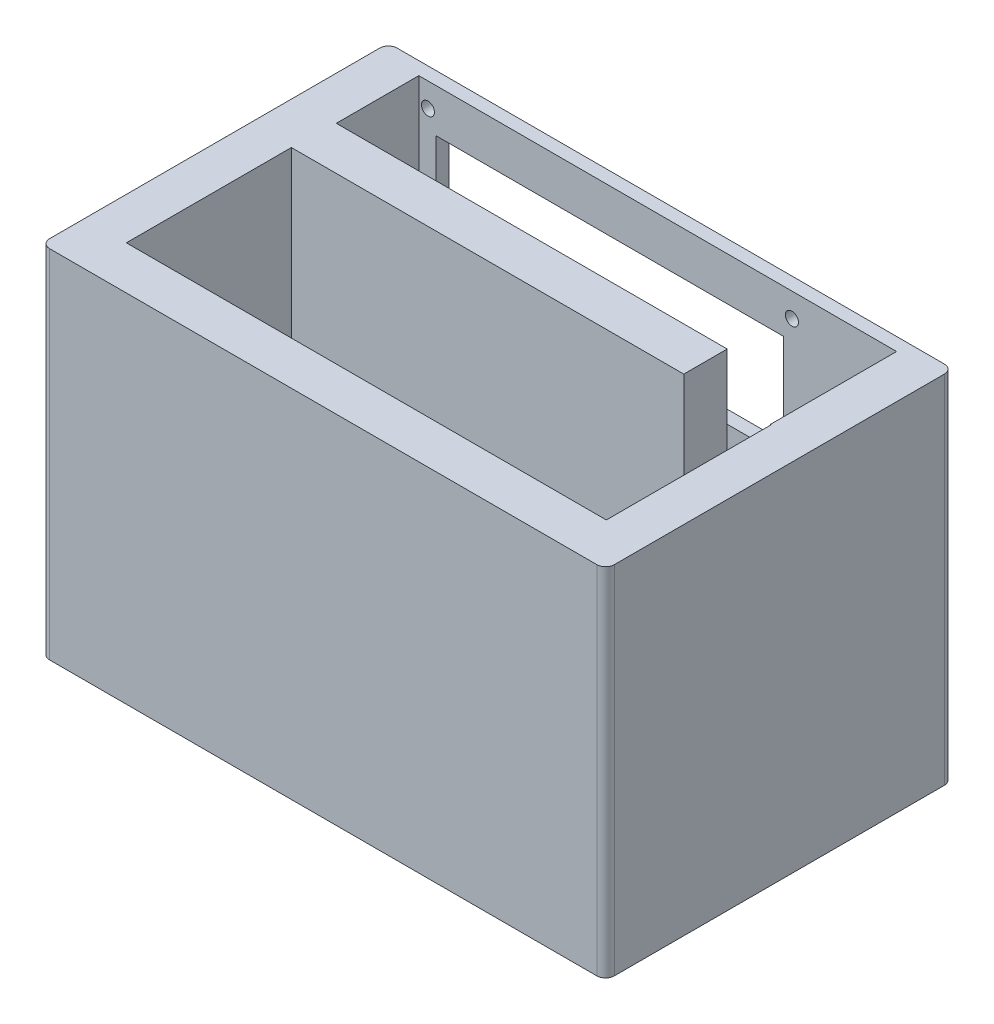
ISO-10303-21;
HEADER;
FILE_DESCRIPTION(('STEP AP214'),'2;1');
FILE_NAME('part.step','',(''),(''),'','','');
FILE_SCHEMA(('AUTOMOTIVE_DESIGN { 1 0 10303 214 1 1 1 1 }'));
ENDSEC;
DATA;
#1=APPLICATION_CONTEXT('core data for automotive mechanical design processes');
#2=APPLICATION_PROTOCOL_DEFINITION('international standard','automotive_design',2000,#1);
#3=PRODUCT_CONTEXT('',#1,'mechanical');
#4=PRODUCT('Part','Part','',(#3));
#5=PRODUCT_RELATED_PRODUCT_CATEGORY('part','',(#4));
#6=PRODUCT_DEFINITION_FORMATION('','',#4);
#7=PRODUCT_DEFINITION_CONTEXT('part definition',#1,'design');
#8=PRODUCT_DEFINITION('design','',#6,#7);
#9=PRODUCT_DEFINITION_SHAPE('','',#8);
#10=(LENGTH_UNIT() NAMED_UNIT(*) SI_UNIT(.MILLI.,.METRE.));
#11=(NAMED_UNIT(*) PLANE_ANGLE_UNIT() SI_UNIT($,.RADIAN.));
#12=(NAMED_UNIT(*) SI_UNIT($,.STERADIAN.) SOLID_ANGLE_UNIT());
#13=UNCERTAINTY_MEASURE_WITH_UNIT(LENGTH_MEASURE(1.E-05),#10,'distance_accuracy_value','');
#14=(GEOMETRIC_REPRESENTATION_CONTEXT(3) GLOBAL_UNCERTAINTY_ASSIGNED_CONTEXT((#13)) GLOBAL_UNIT_ASSIGNED_CONTEXT((#10,
#11,#12)) REPRESENTATION_CONTEXT('',''));
#15=CARTESIAN_POINT('',(0.,0.,0.));
#16=DIRECTION('',(0.,0.,1.));
#17=DIRECTION('',(1.,0.,0.));
#18=AXIS2_PLACEMENT_3D('',#15,#16,#17);
#19=CARTESIAN_POINT('',(-55.3378712972494,4.99999999999999,-8.00000000000001));
#20=DIRECTION('',(0.,0.,-1.));
#21=DIRECTION('',(-1.,0.,0.));
#22=AXIS2_PLACEMENT_3D('',#19,#20,#21);
#23=PLANE('',#22);
#24=DIRECTION('',(-1.,0.,0.));
#25=VECTOR('',#24,1.);
#26=CARTESIAN_POINT('',(-55.3378712972494,4.99999999999999,-8.00000000000001));
#27=LINE('',#26,#25);
#28=CARTESIAN_POINT('',(35.,4.99999999999999,-8.00000000000001));
#29=VERTEX_POINT('',#28);
#30=CARTESIAN_POINT('',(-55.3378712972494,4.99999999999999,-8.00000000000001));
#31=VERTEX_POINT('',#30);
#32=EDGE_CURVE('E282',#29,#31,#27,.T.);
#33=ORIENTED_EDGE('',*,*,#32,.F.);
#34=DIRECTION('',(0.,1.,0.));
#35=VECTOR('',#34,1.);
#36=CARTESIAN_POINT('',(35.,4.99999999999999,-8.00000000000001));
#37=LINE('',#36,#35);
#38=CARTESIAN_POINT('',(35.,82.,-8.00000000000001));
#39=VERTEX_POINT('',#38);
#40=EDGE_CURVE('E274',#29,#39,#37,.T.);
#41=ORIENTED_EDGE('',*,*,#40,.T.);
#42=DIRECTION('',(-1.,0.,0.));
#43=VECTOR('',#42,1.);
#44=CARTESIAN_POINT('',(-55.3378712972494,82.,-8.00000000000001));
#45=LINE('',#44,#43);
#46=CARTESIAN_POINT('',(-55.3378712972494,82.,-8.00000000000001));
#47=VERTEX_POINT('',#46);
#48=EDGE_CURVE('E296',#39,#47,#45,.T.);
#49=ORIENTED_EDGE('',*,*,#48,.T.);
#50=DIRECTION('',(0.,1.,0.));
#51=VECTOR('',#50,1.);
#52=CARTESIAN_POINT('',(-55.3378712972494,4.99999999999999,-8.00000000000001));
#53=LINE('',#52,#51);
#54=EDGE_CURVE('E299',#31,#47,#53,.T.);
#55=ORIENTED_EDGE('',*,*,#54,.F.);
#56=EDGE_LOOP('',(#33,#41,#49,#55));
#57=FACE_BOUND('',#56,.T.);
#58=ADVANCED_FACE('F81',(#57),#23,.F.);
#59=CARTESIAN_POINT('',(-65.,82.,-40.));
#60=DIRECTION('',(1.,0.,0.));
#61=DIRECTION('',(0.,0.,-1.));
#62=AXIS2_PLACEMENT_3D('',#59,#60,#61);
#63=PLANE('',#62);
#64=DIRECTION('',(0.,0.,1.));
#65=VECTOR('',#64,1.);
#66=CARTESIAN_POINT('',(-65.,0.,-40.));
#67=LINE('',#66,#65);
#68=CARTESIAN_POINT('',(-65.,0.,-38.));
#69=VERTEX_POINT('',#68);
#70=CARTESIAN_POINT('',(-65.,0.,38.));
#71=VERTEX_POINT('',#70);
#72=EDGE_CURVE('E362',#69,#71,#67,.T.);
#73=ORIENTED_EDGE('',*,*,#72,.T.);
#74=DIRECTION('',(0.,-1.,0.));
#75=VECTOR('',#74,1.);
#76=CARTESIAN_POINT('',(-65.,82.,38.));
#77=LINE('',#76,#75);
#78=CARTESIAN_POINT('',(-65.,82.,38.));
#79=VERTEX_POINT('',#78);
#80=EDGE_CURVE('E442',#71,#79,#77,.F.);
#81=ORIENTED_EDGE('',*,*,#80,.T.);
#82=DIRECTION('',(0.,0.,1.));
#83=VECTOR('',#82,1.);
#84=CARTESIAN_POINT('',(-65.,82.,-40.));
#85=LINE('',#84,#83);
#86=CARTESIAN_POINT('',(-65.,82.,-38.));
#87=VERTEX_POINT('',#86);
#88=EDGE_CURVE('E366',#87,#79,#85,.T.);
#89=ORIENTED_EDGE('',*,*,#88,.F.);
#90=DIRECTION('',(0.,-1.,0.));
#91=VECTOR('',#90,1.);
#92=CARTESIAN_POINT('',(-65.,82.,-38.));
#93=LINE('',#92,#91);
#94=EDGE_CURVE('E439',#87,#69,#93,.T.);
#95=ORIENTED_EDGE('',*,*,#94,.T.);
#96=EDGE_LOOP('',(#73,#81,#89,#95));
#97=FACE_BOUND('',#96,.T.);
#98=ADVANCED_FACE('F462',(#97),#63,.F.);
#99=CARTESIAN_POINT('',(-65.,82.,40.));
#100=DIRECTION('',(0.,0.,-1.));
#101=DIRECTION('',(-1.,0.,0.));
#102=AXIS2_PLACEMENT_3D('',#99,#100,#101);
#103=PLANE('',#102);
#104=DIRECTION('',(1.,0.,0.));
#105=VECTOR('',#104,1.);
#106=CARTESIAN_POINT('',(-65.,0.,40.));
#107=LINE('',#106,#105);
#108=CARTESIAN_POINT('',(-63.,0.,40.));
#109=VERTEX_POINT('',#108);
#110=CARTESIAN_POINT('',(63.,0.,40.));
#111=VERTEX_POINT('',#110);
#112=EDGE_CURVE('E382',#109,#111,#107,.T.);
#113=ORIENTED_EDGE('',*,*,#112,.T.);
#114=DIRECTION('',(0.,-1.,0.));
#115=VECTOR('',#114,1.);
#116=CARTESIAN_POINT('',(63.,82.,40.));
#117=LINE('',#116,#115);
#118=CARTESIAN_POINT('',(63.,82.,40.));
#119=VERTEX_POINT('',#118);
#120=EDGE_CURVE('E429',#111,#119,#117,.F.);
#121=ORIENTED_EDGE('',*,*,#120,.T.);
#122=DIRECTION('',(1.,0.,0.));
#123=VECTOR('',#122,1.);
#124=CARTESIAN_POINT('',(-65.,82.,40.));
#125=LINE('',#124,#123);
#126=CARTESIAN_POINT('',(-63.,82.,40.));
#127=VERTEX_POINT('',#126);
#128=EDGE_CURVE('E369',#127,#119,#125,.T.);
#129=ORIENTED_EDGE('',*,*,#128,.F.);
#130=DIRECTION('',(0.,-1.,0.));
#131=VECTOR('',#130,1.);
#132=CARTESIAN_POINT('',(-63.,82.,40.));
#133=LINE('',#132,#131);
#134=EDGE_CURVE('E426',#127,#109,#133,.T.);
#135=ORIENTED_EDGE('',*,*,#134,.T.);
#136=EDGE_LOOP('',(#113,#121,#129,#135));
#137=FACE_BOUND('',#136,.T.);
#138=ADVANCED_FACE('F473',(#137),#103,.F.);
#139=CARTESIAN_POINT('',(65.,82.,-40.));
#140=DIRECTION('',(-1.,0.,0.));
#141=DIRECTION('',(0.,0.,1.));
#142=AXIS2_PLACEMENT_3D('',#139,#140,#141);
#143=PLANE('',#142);
#144=DIRECTION('',(0.,0.,-1.));
#145=VECTOR('',#144,1.);
#146=CARTESIAN_POINT('',(65.,82.,-40.));
#147=LINE('',#146,#145);
#148=CARTESIAN_POINT('',(65.,82.,38.));
#149=VERTEX_POINT('',#148);
#150=CARTESIAN_POINT('',(65.,82.,-38.));
#151=VERTEX_POINT('',#150);
#152=EDGE_CURVE('E373',#149,#151,#147,.T.);
#153=ORIENTED_EDGE('',*,*,#152,.F.);
#154=DIRECTION('',(0.,-1.,0.));
#155=VECTOR('',#154,1.);
#156=CARTESIAN_POINT('',(65.,82.,38.));
#157=LINE('',#156,#155);
#158=CARTESIAN_POINT('',(65.,0.,38.));
#159=VERTEX_POINT('',#158);
#160=EDGE_CURVE('E415',#149,#159,#157,.T.);
#161=ORIENTED_EDGE('',*,*,#160,.T.);
#162=DIRECTION('',(0.,0.,-1.));
#163=VECTOR('',#162,1.);
#164=CARTESIAN_POINT('',(65.,0.,-40.));
#165=LINE('',#164,#163);
#166=CARTESIAN_POINT('',(65.,0.,-38.));
#167=VERTEX_POINT('',#166);
#168=EDGE_CURVE('E385',#159,#167,#165,.T.);
#169=ORIENTED_EDGE('',*,*,#168,.T.);
#170=DIRECTION('',(0.,-1.,0.));
#171=VECTOR('',#170,1.);
#172=CARTESIAN_POINT('',(65.,82.,-38.));
#173=LINE('',#172,#171);
#174=EDGE_CURVE('E413',#167,#151,#173,.F.);
#175=ORIENTED_EDGE('',*,*,#174,.T.);
#176=EDGE_LOOP('',(#153,#161,#169,#175));
#177=FACE_BOUND('',#176,.T.);
#178=ADVANCED_FACE('F481',(#177),#143,.F.);
#179=CARTESIAN_POINT('',(-65.,82.,-40.));
#180=DIRECTION('',(0.,0.,1.));
#181=DIRECTION('',(1.,0.,0.));
#182=AXIS2_PLACEMENT_3D('',#179,#180,#181);
#183=PLANE('',#182);
#184=CARTESIAN_POINT('',(-52.9,8.49999999999999,-40.));
#185=DIRECTION('',(0.,0.,1.));
#186=DIRECTION('',(1.,0.,0.));
#187=AXIS2_PLACEMENT_3D('',#184,#185,#186);
#188=CIRCLE('',#187,1.5);
#189=CARTESIAN_POINT('',(-51.4,8.49999999999999,-40.));
#190=VERTEX_POINT('',#189);
#191=EDGE_CURVE('E750',#190,#190,#188,.T.);
#192=ORIENTED_EDGE('',*,*,#191,.T.);
#193=EDGE_LOOP('',(#192));
#194=FACE_BOUND('',#193,.T.);
#195=CARTESIAN_POINT('',(30.9,8.49999999999999,-40.));
#196=DIRECTION('',(0.,0.,-1.));
#197=DIRECTION('',(-1.,0.,0.));
#198=AXIS2_PLACEMENT_3D('',#195,#196,#197);
#199=CIRCLE('',#198,1.5);
#200=CARTESIAN_POINT('',(29.4,8.49999999999999,-40.));
#201=VERTEX_POINT('',#200);
#202=EDGE_CURVE('E760',#201,#201,#199,.T.);
#203=ORIENTED_EDGE('',*,*,#202,.F.);
#204=EDGE_LOOP('',(#203));
#205=FACE_BOUND('',#204,.T.);
#206=CARTESIAN_POINT('',(-52.9,76.5,-40.));
#207=DIRECTION('',(0.,0.,1.));
#208=DIRECTION('',(1.,0.,0.));
#209=AXIS2_PLACEMENT_3D('',#206,#207,#208);
#210=CIRCLE('',#209,1.5);
#211=CARTESIAN_POINT('',(-51.4,76.5,-40.));
#212=VERTEX_POINT('',#211);
#213=EDGE_CURVE('E764',#212,#212,#210,.T.);
#214=ORIENTED_EDGE('',*,*,#213,.T.);
#215=EDGE_LOOP('',(#214));
#216=FACE_BOUND('',#215,.T.);
#217=CARTESIAN_POINT('',(30.9,76.5,-40.));
#218=DIRECTION('',(0.,0.,-1.));
#219=DIRECTION('',(-1.,0.,0.));
#220=AXIS2_PLACEMENT_3D('',#217,#218,#219);
#221=CIRCLE('',#220,1.5);
#222=CARTESIAN_POINT('',(29.4,76.5,-40.));
#223=VERTEX_POINT('',#222);
#224=EDGE_CURVE('E772',#223,#223,#221,.T.);
#225=ORIENTED_EDGE('',*,*,#224,.F.);
#226=EDGE_LOOP('',(#225));
#227=FACE_BOUND('',#226,.T.);
#228=CARTESIAN_POINT('',(-52.9,45.5,-40.));
#229=DIRECTION('',(0.,0.,1.));
#230=DIRECTION('',(1.,0.,0.));
#231=AXIS2_PLACEMENT_3D('',#228,#229,#230);
#232=CIRCLE('',#231,1.5);
#233=CARTESIAN_POINT('',(-51.4,45.5,-40.));
#234=VERTEX_POINT('',#233);
#235=EDGE_CURVE('E776',#234,#234,#232,.T.);
#236=ORIENTED_EDGE('',*,*,#235,.T.);
#237=EDGE_LOOP('',(#236));
#238=FACE_BOUND('',#237,.T.);
#239=CARTESIAN_POINT('',(-52.9,39.5,-40.));
#240=DIRECTION('',(0.,0.,1.));
#241=DIRECTION('',(1.,0.,0.));
#242=AXIS2_PLACEMENT_3D('',#239,#240,#241);
#243=CIRCLE('',#242,1.5);
#244=CARTESIAN_POINT('',(-51.4,39.5,-40.));
#245=VERTEX_POINT('',#244);
#246=EDGE_CURVE('E782',#245,#245,#243,.T.);
#247=ORIENTED_EDGE('',*,*,#246,.T.);
#248=EDGE_LOOP('',(#247));
#249=FACE_BOUND('',#248,.T.);
#250=CARTESIAN_POINT('',(30.9,45.5,-40.));
#251=DIRECTION('',(0.,0.,-1.));
#252=DIRECTION('',(-1.,0.,0.));
#253=AXIS2_PLACEMENT_3D('',#250,#251,#252);
#254=CIRCLE('',#253,1.5);
#255=CARTESIAN_POINT('',(29.4,45.5,-40.));
#256=VERTEX_POINT('',#255);
#257=EDGE_CURVE('E790',#256,#256,#254,.T.);
#258=ORIENTED_EDGE('',*,*,#257,.F.);
#259=EDGE_LOOP('',(#258));
#260=FACE_BOUND('',#259,.T.);
#261=CARTESIAN_POINT('',(30.9,39.5,-40.));
#262=DIRECTION('',(0.,0.,-1.));
#263=DIRECTION('',(-1.,0.,0.));
#264=AXIS2_PLACEMENT_3D('',#261,#262,#263);
#265=CIRCLE('',#264,1.5);
#266=CARTESIAN_POINT('',(29.4,39.5,-40.));
#267=VERTEX_POINT('',#266);
#268=EDGE_CURVE('E796',#267,#267,#265,.T.);
#269=ORIENTED_EDGE('',*,*,#268,.F.);
#270=EDGE_LOOP('',(#269));
#271=FACE_BOUND('',#270,.T.);
#272=DIRECTION('',(-1.,0.,0.));
#273=VECTOR('',#272,1.);
#274=CARTESIAN_POINT('',(29.,48.,-40.));
#275=LINE('',#274,#273);
#276=CARTESIAN_POINT('',(29.,48.,-40.));
#277=VERTEX_POINT('',#276);
#278=CARTESIAN_POINT('',(-51.,48.,-40.));
#279=VERTEX_POINT('',#278);
#280=EDGE_CURVE('E306',#277,#279,#275,.T.);
#281=ORIENTED_EDGE('',*,*,#280,.F.);
#282=DIRECTION('',(0.,-1.,0.));
#283=VECTOR('',#282,1.);
#284=CARTESIAN_POINT('',(29.,72.,-40.));
#285=LINE('',#284,#283);
#286=CARTESIAN_POINT('',(29.,72.,-40.));
#287=VERTEX_POINT('',#286);
#288=EDGE_CURVE('E301',#287,#277,#285,.T.);
#289=ORIENTED_EDGE('',*,*,#288,.F.);
#290=DIRECTION('',(1.,0.,0.));
#291=VECTOR('',#290,1.);
#292=CARTESIAN_POINT('',(29.,72.,-40.));
#293=LINE('',#292,#291);
#294=CARTESIAN_POINT('',(-51.,72.,-40.));
#295=VERTEX_POINT('',#294);
#296=EDGE_CURVE('E312',#295,#287,#293,.T.);
#297=ORIENTED_EDGE('',*,*,#296,.F.);
#298=DIRECTION('',(0.,1.,0.));
#299=VECTOR('',#298,1.);
#300=CARTESIAN_POINT('',(-51.,72.,-40.));
#301=LINE('',#300,#299);
#302=EDGE_CURVE('E309',#279,#295,#301,.T.);
#303=ORIENTED_EDGE('',*,*,#302,.F.);
#304=EDGE_LOOP('',(#281,#289,#297,#303));
#305=FACE_BOUND('',#304,.T.);
#306=DIRECTION('',(-1.,0.,0.));
#307=VECTOR('',#306,1.);
#308=CARTESIAN_POINT('',(29.,11.,-40.));
#309=LINE('',#308,#307);
#310=CARTESIAN_POINT('',(29.,11.,-40.));
#311=VERTEX_POINT('',#310);
#312=CARTESIAN_POINT('',(-51.,11.,-40.));
#313=VERTEX_POINT('',#312);
#314=EDGE_CURVE('E326',#311,#313,#309,.T.);
#315=ORIENTED_EDGE('',*,*,#314,.F.);
#316=DIRECTION('',(0.,-1.,0.));
#317=VECTOR('',#316,1.);
#318=CARTESIAN_POINT('',(29.,35.,-40.));
#319=LINE('',#318,#317);
#320=CARTESIAN_POINT('',(29.,35.,-40.));
#321=VERTEX_POINT('',#320);
#322=EDGE_CURVE('E318',#321,#311,#319,.T.);
#323=ORIENTED_EDGE('',*,*,#322,.F.);
#324=DIRECTION('',(1.,0.,0.));
#325=VECTOR('',#324,1.);
#326=CARTESIAN_POINT('',(29.,35.,-40.));
#327=LINE('',#326,#325);
#328=CARTESIAN_POINT('',(-51.,35.,-40.));
#329=VERTEX_POINT('',#328);
#330=EDGE_CURVE('E332',#329,#321,#327,.T.);
#331=ORIENTED_EDGE('',*,*,#330,.F.);
#332=DIRECTION('',(0.,1.,0.));
#333=VECTOR('',#332,1.);
#334=CARTESIAN_POINT('',(-51.,35.,-40.));
#335=LINE('',#334,#333);
#336=EDGE_CURVE('E329',#313,#329,#335,.T.);
#337=ORIENTED_EDGE('',*,*,#336,.F.);
#338=EDGE_LOOP('',(#315,#323,#331,#337));
#339=FACE_BOUND('',#338,.T.);
#340=DIRECTION('',(-1.,0.,0.));
#341=VECTOR('',#340,1.);
#342=CARTESIAN_POINT('',(-65.,0.,-40.));
#343=LINE('',#342,#341);
#344=CARTESIAN_POINT('',(63.,0.,-40.));
#345=VERTEX_POINT('',#344);
#346=CARTESIAN_POINT('',(-63.,0.,-40.));
#347=VERTEX_POINT('',#346);
#348=EDGE_CURVE('E370',#345,#347,#343,.T.);
#349=ORIENTED_EDGE('',*,*,#348,.T.);
#350=DIRECTION('',(0.,-1.,0.));
#351=VECTOR('',#350,1.);
#352=CARTESIAN_POINT('',(-63.,82.,-40.));
#353=LINE('',#352,#351);
#354=CARTESIAN_POINT('',(-63.,82.,-40.));
#355=VERTEX_POINT('',#354);
#356=EDGE_CURVE('E12',#347,#355,#353,.F.);
#357=ORIENTED_EDGE('',*,*,#356,.T.);
#358=DIRECTION('',(-1.,0.,0.));
#359=VECTOR('',#358,1.);
#360=CARTESIAN_POINT('',(-65.,82.,-40.));
#361=LINE('',#360,#359);
#362=CARTESIAN_POINT('',(63.,82.,-40.));
#363=VERTEX_POINT('',#362);
#364=EDGE_CURVE('E376',#363,#355,#361,.T.);
#365=ORIENTED_EDGE('',*,*,#364,.F.);
#366=DIRECTION('',(0.,-1.,0.));
#367=VECTOR('',#366,1.);
#368=CARTESIAN_POINT('',(63.,82.,-40.));
#369=LINE('',#368,#367);
#370=EDGE_CURVE('E89',#363,#345,#369,.T.);
#371=ORIENTED_EDGE('',*,*,#370,.T.);
#372=EDGE_LOOP('',(#349,#357,#365,#371));
#373=FACE_BOUND('',#372,.T.);
#374=ADVANCED_FACE('F448',(#194,#205,#216,#227,#238,#249,#260,#271,#305,#339,#373),#183,.F.);
#375=CARTESIAN_POINT('',(0.,82.,0.));
#376=DIRECTION('',(0.,1.,0.));
#377=DIRECTION('',(0.,0.,1.));
#378=AXIS2_PLACEMENT_3D('',#375,#376,#377);
#379=PLANE('',#378);
#380=DIRECTION('',(0.,0.,1.));
#381=VECTOR('',#380,1.);
#382=CARTESIAN_POINT('',(35.,82.,-8.00000000000001));
#383=LINE('',#382,#381);
#384=CARTESIAN_POINT('',(35.,82.,-18.));
#385=VERTEX_POINT('',#384);
#386=EDGE_CURVE('E799',#385,#39,#383,.T.);
#387=ORIENTED_EDGE('',*,*,#386,.F.);
#388=DIRECTION('',(1.,0.,0.));
#389=VECTOR('',#388,1.);
#390=CARTESIAN_POINT('',(55.,82.,-18.));
#391=LINE('',#390,#389);
#392=CARTESIAN_POINT('',(-55.,82.,-18.));
#393=VERTEX_POINT('',#392);
#394=EDGE_CURVE('E265',#393,#385,#391,.T.);
#395=ORIENTED_EDGE('',*,*,#394,.F.);
#396=DIRECTION('',(0.,0.,1.));
#397=VECTOR('',#396,1.);
#398=CARTESIAN_POINT('',(-55.,82.,-18.));
#399=LINE('',#398,#397);
#400=CARTESIAN_POINT('',(-55.,82.,-37.));
#401=VERTEX_POINT('',#400);
#402=EDGE_CURVE('E355',#401,#393,#399,.T.);
#403=ORIENTED_EDGE('',*,*,#402,.F.);
#404=DIRECTION('',(-1.,0.,0.));
#405=VECTOR('',#404,1.);
#406=CARTESIAN_POINT('',(55.,82.,-37.));
#407=LINE('',#406,#405);
#408=CARTESIAN_POINT('',(55.,82.,-37.));
#409=VERTEX_POINT('',#408);
#410=EDGE_CURVE('E352',#409,#401,#407,.T.);
#411=ORIENTED_EDGE('',*,*,#410,.F.);
#412=DIRECTION('',(0.,0.,-1.));
#413=VECTOR('',#412,1.);
#414=CARTESIAN_POINT('',(55.,82.,-18.));
#415=LINE('',#414,#413);
#416=CARTESIAN_POINT('',(55.,82.,-8.00000000000001));
#417=VERTEX_POINT('',#416);
#418=EDGE_CURVE('E338',#417,#409,#415,.T.);
#419=ORIENTED_EDGE('',*,*,#418,.F.);
#420=CARTESIAN_POINT('',(55.1719406486813,82.,-8.00000000000001));
#421=VERTEX_POINT('',#420);
#422=EDGE_CURVE('E272',#421,#417,#45,.T.);
#423=ORIENTED_EDGE('',*,*,#422,.F.);
#424=DIRECTION('',(0.,0.,-1.));
#425=VECTOR('',#424,1.);
#426=CARTESIAN_POINT('',(55.1719406486813,82.,30.));
#427=LINE('',#426,#425);
#428=CARTESIAN_POINT('',(55.1719406486813,82.,30.));
#429=VERTEX_POINT('',#428);
#430=EDGE_CURVE('E293',#429,#421,#427,.T.);
#431=ORIENTED_EDGE('',*,*,#430,.F.);
#432=DIRECTION('',(1.,0.,0.));
#433=VECTOR('',#432,1.);
#434=CARTESIAN_POINT('',(-55.3378712972494,82.,30.));
#435=LINE('',#434,#433);
#436=CARTESIAN_POINT('',(-55.3378712972494,82.,30.));
#437=VERTEX_POINT('',#436);
#438=EDGE_CURVE('E290',#437,#429,#435,.T.);
#439=ORIENTED_EDGE('',*,*,#438,.F.);
#440=DIRECTION('',(0.,0.,1.));
#441=VECTOR('',#440,1.);
#442=CARTESIAN_POINT('',(-55.3378712972494,82.,30.));
#443=LINE('',#442,#441);
#444=EDGE_CURVE('E104',#47,#437,#443,.T.);
#445=ORIENTED_EDGE('',*,*,#444,.F.);
#446=ORIENTED_EDGE('',*,*,#48,.F.);
#447=EDGE_LOOP('',(#387,#395,#403,#411,#419,#423,#431,#439,#445,#446));
#448=FACE_BOUND('',#447,.T.);
#449=ORIENTED_EDGE('',*,*,#128,.T.);
#450=CARTESIAN_POINT('',(63.,82.,38.));
#451=DIRECTION('',(0.,1.,0.));
#452=DIRECTION('',(0.,0.,1.));
#453=AXIS2_PLACEMENT_3D('',#450,#451,#452);
#454=CIRCLE('',#453,2.);
#455=EDGE_CURVE('E437',#119,#149,#454,.T.);
#456=ORIENTED_EDGE('',*,*,#455,.T.);
#457=ORIENTED_EDGE('',*,*,#152,.T.);
#458=CARTESIAN_POINT('',(63.,82.,-38.));
#459=DIRECTION('',(0.,1.,0.));
#460=DIRECTION('',(0.,0.,1.));
#461=AXIS2_PLACEMENT_3D('',#458,#459,#460);
#462=CIRCLE('',#461,2.);
#463=EDGE_CURVE('E431',#151,#363,#462,.T.);
#464=ORIENTED_EDGE('',*,*,#463,.T.);
#465=ORIENTED_EDGE('',*,*,#364,.T.);
#466=CARTESIAN_POINT('',(-63.,82.,-38.));
#467=DIRECTION('',(0.,1.,0.));
#468=DIRECTION('',(0.,0.,1.));
#469=AXIS2_PLACEMENT_3D('',#466,#467,#468);
#470=CIRCLE('',#469,2.);
#471=EDGE_CURVE('E433',#355,#87,#470,.T.);
#472=ORIENTED_EDGE('',*,*,#471,.T.);
#473=ORIENTED_EDGE('',*,*,#88,.T.);
#474=CARTESIAN_POINT('',(-63.,82.,38.));
#475=DIRECTION('',(0.,1.,0.));
#476=DIRECTION('',(0.,0.,1.));
#477=AXIS2_PLACEMENT_3D('',#474,#475,#476);
#478=CIRCLE('',#477,2.);
#479=EDGE_CURVE('E435',#79,#127,#478,.T.);
#480=ORIENTED_EDGE('',*,*,#479,.T.);
#481=EDGE_LOOP('',(#449,#456,#457,#464,#465,#472,#473,#480));
#482=FACE_BOUND('',#481,.T.);
#483=ADVANCED_FACE('F466',(#448,#482),#379,.T.);
#484=CARTESIAN_POINT('',(0.,0.,0.));
#485=DIRECTION('',(0.,1.,0.));
#486=DIRECTION('',(0.,0.,1.));
#487=AXIS2_PLACEMENT_3D('',#484,#485,#486);
#488=PLANE('',#487);
#489=ORIENTED_EDGE('',*,*,#168,.F.);
#490=CARTESIAN_POINT('',(63.,0.,38.));
#491=DIRECTION('',(0.,1.,0.));
#492=DIRECTION('',(0.,0.,1.));
#493=AXIS2_PLACEMENT_3D('',#490,#491,#492);
#494=CIRCLE('',#493,2.);
#495=EDGE_CURVE('E424',#159,#111,#494,.F.);
#496=ORIENTED_EDGE('',*,*,#495,.T.);
#497=ORIENTED_EDGE('',*,*,#112,.F.);
#498=CARTESIAN_POINT('',(-63.,0.,38.));
#499=DIRECTION('',(0.,1.,0.));
#500=DIRECTION('',(0.,0.,1.));
#501=AXIS2_PLACEMENT_3D('',#498,#499,#500);
#502=CIRCLE('',#501,2.);
#503=EDGE_CURVE('E422',#109,#71,#502,.F.);
#504=ORIENTED_EDGE('',*,*,#503,.T.);
#505=ORIENTED_EDGE('',*,*,#72,.F.);
#506=CARTESIAN_POINT('',(-63.,0.,-38.));
#507=DIRECTION('',(0.,1.,0.));
#508=DIRECTION('',(0.,0.,1.));
#509=AXIS2_PLACEMENT_3D('',#506,#507,#508);
#510=CIRCLE('',#509,2.);
#511=EDGE_CURVE('E420',#69,#347,#510,.F.);
#512=ORIENTED_EDGE('',*,*,#511,.T.);
#513=ORIENTED_EDGE('',*,*,#348,.F.);
#514=CARTESIAN_POINT('',(63.,0.,-38.));
#515=DIRECTION('',(0.,1.,0.));
#516=DIRECTION('',(0.,0.,1.));
#517=AXIS2_PLACEMENT_3D('',#514,#515,#516);
#518=CIRCLE('',#517,2.);
#519=EDGE_CURVE('E418',#345,#167,#518,.F.);
#520=ORIENTED_EDGE('',*,*,#519,.T.);
#521=EDGE_LOOP('',(#489,#496,#497,#504,#505,#512,#513,#520));
#522=FACE_BOUND('',#521,.T.);
#523=ADVANCED_FACE('F454',(#522),#488,.F.);
#524=CARTESIAN_POINT('',(55.,4.99999999999999,-18.));
#525=DIRECTION('',(1.,0.,0.));
#526=DIRECTION('',(0.,0.,-1.));
#527=AXIS2_PLACEMENT_3D('',#524,#525,#526);
#528=PLANE('',#527);
#529=ORIENTED_EDGE('',*,*,#418,.T.);
#530=DIRECTION('',(0.,1.,0.));
#531=VECTOR('',#530,1.);
#532=CARTESIAN_POINT('',(55.,4.99999999999999,-37.));
#533=LINE('',#532,#531);
#534=CARTESIAN_POINT('',(55.,4.99999999999999,-37.));
#535=VERTEX_POINT('',#534);
#536=EDGE_CURVE('E260',#535,#409,#533,.T.);
#537=ORIENTED_EDGE('',*,*,#536,.F.);
#538=DIRECTION('',(0.,0.,-1.));
#539=VECTOR('',#538,1.);
#540=CARTESIAN_POINT('',(55.,4.99999999999999,-18.));
#541=LINE('',#540,#539);
#542=CARTESIAN_POINT('',(55.,4.99999999999999,-8.00000000000001));
#543=VERTEX_POINT('',#542);
#544=EDGE_CURVE('E254',#543,#535,#541,.T.);
#545=ORIENTED_EDGE('',*,*,#544,.F.);
#546=DIRECTION('',(0.,1.,0.));
#547=VECTOR('',#546,1.);
#548=CARTESIAN_POINT('',(55.,4.99999999999999,-8.00000000000001));
#549=LINE('',#548,#547);
#550=EDGE_CURVE('E257',#543,#417,#549,.T.);
#551=ORIENTED_EDGE('',*,*,#550,.T.);
#552=EDGE_LOOP('',(#529,#537,#545,#551));
#553=FACE_BOUND('',#552,.T.);
#554=ADVANCED_FACE('F256',(#553),#528,.F.);
#555=CARTESIAN_POINT('',(55.,4.99999999999999,-18.));
#556=DIRECTION('',(0.,0.,1.));
#557=DIRECTION('',(1.,0.,0.));
#558=AXIS2_PLACEMENT_3D('',#555,#556,#557);
#559=PLANE('',#558);
#560=ORIENTED_EDGE('',*,*,#394,.T.);
#561=DIRECTION('',(0.,1.,0.));
#562=VECTOR('',#561,1.);
#563=CARTESIAN_POINT('',(35.,4.99999999999999,-18.));
#564=LINE('',#563,#562);
#565=CARTESIAN_POINT('',(35.,4.99999999999999,-18.));
#566=VERTEX_POINT('',#565);
#567=EDGE_CURVE('E273',#566,#385,#564,.T.);
#568=ORIENTED_EDGE('',*,*,#567,.F.);
#569=DIRECTION('',(1.,0.,0.));
#570=VECTOR('',#569,1.);
#571=CARTESIAN_POINT('',(55.,4.99999999999999,-18.));
#572=LINE('',#571,#570);
#573=CARTESIAN_POINT('',(-55.,4.99999999999999,-18.));
#574=VERTEX_POINT('',#573);
#575=EDGE_CURVE('E349',#574,#566,#572,.T.);
#576=ORIENTED_EDGE('',*,*,#575,.F.);
#577=DIRECTION('',(0.,1.,0.));
#578=VECTOR('',#577,1.);
#579=CARTESIAN_POINT('',(-55.,4.99999999999999,-18.));
#580=LINE('',#579,#578);
#581=EDGE_CURVE('E360',#574,#393,#580,.T.);
#582=ORIENTED_EDGE('',*,*,#581,.T.);
#583=EDGE_LOOP('',(#560,#568,#576,#582));
#584=FACE_BOUND('',#583,.T.);
#585=ADVANCED_FACE('F549',(#584),#559,.F.);
#586=CARTESIAN_POINT('',(-55.,4.99999999999999,-18.));
#587=DIRECTION('',(-1.,0.,0.));
#588=DIRECTION('',(0.,0.,1.));
#589=AXIS2_PLACEMENT_3D('',#586,#587,#588);
#590=PLANE('',#589);
#591=ORIENTED_EDGE('',*,*,#402,.T.);
#592=ORIENTED_EDGE('',*,*,#581,.F.);
#593=DIRECTION('',(0.,0.,1.));
#594=VECTOR('',#593,1.);
#595=CARTESIAN_POINT('',(-55.,4.99999999999999,-18.));
#596=LINE('',#595,#594);
#597=CARTESIAN_POINT('',(-55.,4.99999999999999,-37.));
#598=VERTEX_POINT('',#597);
#599=EDGE_CURVE('E346',#598,#574,#596,.T.);
#600=ORIENTED_EDGE('',*,*,#599,.F.);
#601=DIRECTION('',(0.,1.,0.));
#602=VECTOR('',#601,1.);
#603=CARTESIAN_POINT('',(-55.,4.99999999999999,-37.));
#604=LINE('',#603,#602);
#605=EDGE_CURVE('E363',#598,#401,#604,.T.);
#606=ORIENTED_EDGE('',*,*,#605,.T.);
#607=EDGE_LOOP('',(#591,#592,#600,#606));
#608=FACE_BOUND('',#607,.T.);
#609=ADVANCED_FACE('F552',(#608),#590,.F.);
#610=CARTESIAN_POINT('',(55.,4.99999999999999,-37.));
#611=DIRECTION('',(0.,0.,-1.));
#612=DIRECTION('',(-1.,0.,0.));
#613=AXIS2_PLACEMENT_3D('',#610,#611,#612);
#614=PLANE('',#613);
#615=CARTESIAN_POINT('',(-52.9,8.49999999999999,-37.));
#616=DIRECTION('',(0.,0.,-1.));
#617=DIRECTION('',(-1.,0.,0.));
#618=AXIS2_PLACEMENT_3D('',#615,#616,#617);
#619=CIRCLE('',#618,1.5);
#620=CARTESIAN_POINT('',(-54.4,8.49999999999999,-37.));
#621=VERTEX_POINT('',#620);
#622=EDGE_CURVE('E753',#621,#621,#619,.T.);
#623=ORIENTED_EDGE('',*,*,#622,.T.);
#624=EDGE_LOOP('',(#623));
#625=FACE_BOUND('',#624,.T.);
#626=CARTESIAN_POINT('',(30.9,8.49999999999999,-37.));
#627=DIRECTION('',(0.,0.,-1.));
#628=DIRECTION('',(-1.,0.,0.));
#629=AXIS2_PLACEMENT_3D('',#626,#627,#628);
#630=CIRCLE('',#629,1.5);
#631=CARTESIAN_POINT('',(29.4,8.49999999999999,-37.));
#632=VERTEX_POINT('',#631);
#633=EDGE_CURVE('E755',#632,#632,#630,.F.);
#634=ORIENTED_EDGE('',*,*,#633,.F.);
#635=EDGE_LOOP('',(#634));
#636=FACE_BOUND('',#635,.T.);
#637=CARTESIAN_POINT('',(-52.9,76.5,-37.));
#638=DIRECTION('',(0.,0.,-1.));
#639=DIRECTION('',(-1.,0.,0.));
#640=AXIS2_PLACEMENT_3D('',#637,#638,#639);
#641=CIRCLE('',#640,1.5);
#642=CARTESIAN_POINT('',(-54.4,76.5,-37.));
#643=VERTEX_POINT('',#642);
#644=EDGE_CURVE('E763',#643,#643,#641,.T.);
#645=ORIENTED_EDGE('',*,*,#644,.T.);
#646=EDGE_LOOP('',(#645));
#647=FACE_BOUND('',#646,.T.);
#648=CARTESIAN_POINT('',(30.9,76.5,-37.));
#649=DIRECTION('',(0.,0.,-1.));
#650=DIRECTION('',(-1.,0.,0.));
#651=AXIS2_PLACEMENT_3D('',#648,#649,#650);
#652=CIRCLE('',#651,1.5);
#653=CARTESIAN_POINT('',(29.4,76.5,-37.));
#654=VERTEX_POINT('',#653);
#655=EDGE_CURVE('E767',#654,#654,#652,.F.);
#656=ORIENTED_EDGE('',*,*,#655,.F.);
#657=EDGE_LOOP('',(#656));
#658=FACE_BOUND('',#657,.T.);
#659=CARTESIAN_POINT('',(-52.9,45.5,-37.));
#660=DIRECTION('',(0.,0.,-1.));
#661=DIRECTION('',(-1.,0.,0.));
#662=AXIS2_PLACEMENT_3D('',#659,#660,#661);
#663=CIRCLE('',#662,1.5);
#664=CARTESIAN_POINT('',(-54.4,45.5,-37.));
#665=VERTEX_POINT('',#664);
#666=EDGE_CURVE('E775',#665,#665,#663,.T.);
#667=ORIENTED_EDGE('',*,*,#666,.T.);
#668=EDGE_LOOP('',(#667));
#669=FACE_BOUND('',#668,.T.);
#670=CARTESIAN_POINT('',(-52.9,39.5,-37.));
#671=DIRECTION('',(0.,0.,-1.));
#672=DIRECTION('',(-1.,0.,0.));
#673=AXIS2_PLACEMENT_3D('',#670,#671,#672);
#674=CIRCLE('',#673,1.5);
#675=CARTESIAN_POINT('',(-54.4,39.5,-37.));
#676=VERTEX_POINT('',#675);
#677=EDGE_CURVE('E779',#676,#676,#674,.T.);
#678=ORIENTED_EDGE('',*,*,#677,.T.);
#679=EDGE_LOOP('',(#678));
#680=FACE_BOUND('',#679,.T.);
#681=CARTESIAN_POINT('',(30.9,45.5,-37.));
#682=DIRECTION('',(0.,0.,-1.));
#683=DIRECTION('',(-1.,0.,0.));
#684=AXIS2_PLACEMENT_3D('',#681,#682,#683);
#685=CIRCLE('',#684,1.5);
#686=CARTESIAN_POINT('',(29.4,45.5,-37.));
#687=VERTEX_POINT('',#686);
#688=EDGE_CURVE('E785',#687,#687,#685,.F.);
#689=ORIENTED_EDGE('',*,*,#688,.F.);
#690=EDGE_LOOP('',(#689));
#691=FACE_BOUND('',#690,.T.);
#692=CARTESIAN_POINT('',(30.9,39.5,-37.));
#693=DIRECTION('',(0.,0.,-1.));
#694=DIRECTION('',(-1.,0.,0.));
#695=AXIS2_PLACEMENT_3D('',#692,#693,#694);
#696=CIRCLE('',#695,1.5);
#697=CARTESIAN_POINT('',(29.4,39.5,-37.));
#698=VERTEX_POINT('',#697);
#699=EDGE_CURVE('E793',#698,#698,#696,.F.);
#700=ORIENTED_EDGE('',*,*,#699,.F.);
#701=EDGE_LOOP('',(#700));
#702=FACE_BOUND('',#701,.T.);
#703=DIRECTION('',(1.,0.,0.));
#704=VECTOR('',#703,1.);
#705=CARTESIAN_POINT('',(55.,72.,-37.));
#706=LINE('',#705,#704);
#707=CARTESIAN_POINT('',(-51.,72.,-37.));
#708=VERTEX_POINT('',#707);
#709=CARTESIAN_POINT('',(29.,72.,-37.));
#710=VERTEX_POINT('',#709);
#711=EDGE_CURVE('E407',#708,#710,#706,.T.);
#712=ORIENTED_EDGE('',*,*,#711,.T.);
#713=DIRECTION('',(0.,-1.,0.));
#714=VECTOR('',#713,1.);
#715=CARTESIAN_POINT('',(29.,4.99999999999999,-37.));
#716=LINE('',#715,#714);
#717=CARTESIAN_POINT('',(29.,48.,-37.));
#718=VERTEX_POINT('',#717);
#719=EDGE_CURVE('E410',#710,#718,#716,.T.);
#720=ORIENTED_EDGE('',*,*,#719,.T.);
#721=DIRECTION('',(-1.,0.,0.));
#722=VECTOR('',#721,1.);
#723=CARTESIAN_POINT('',(55.,48.,-37.));
#724=LINE('',#723,#722);
#725=CARTESIAN_POINT('',(-51.,48.,-37.));
#726=VERTEX_POINT('',#725);
#727=EDGE_CURVE('E401',#718,#726,#724,.T.);
#728=ORIENTED_EDGE('',*,*,#727,.T.);
#729=DIRECTION('',(0.,1.,0.));
#730=VECTOR('',#729,1.);
#731=CARTESIAN_POINT('',(-51.,5.00000000000005,-37.));
#732=LINE('',#731,#730);
#733=EDGE_CURVE('E404',#726,#708,#732,.T.);
#734=ORIENTED_EDGE('',*,*,#733,.T.);
#735=EDGE_LOOP('',(#712,#720,#728,#734));
#736=FACE_BOUND('',#735,.T.);
#737=DIRECTION('',(1.,0.,0.));
#738=VECTOR('',#737,1.);
#739=CARTESIAN_POINT('',(55.,35.,-37.));
#740=LINE('',#739,#738);
#741=CARTESIAN_POINT('',(-51.,35.,-37.));
#742=VERTEX_POINT('',#741);
#743=CARTESIAN_POINT('',(29.,35.,-37.));
#744=VERTEX_POINT('',#743);
#745=EDGE_CURVE('E395',#742,#744,#740,.T.);
#746=ORIENTED_EDGE('',*,*,#745,.T.);
#747=DIRECTION('',(0.,-1.,0.));
#748=VECTOR('',#747,1.);
#749=CARTESIAN_POINT('',(29.,4.99999999999999,-37.));
#750=LINE('',#749,#748);
#751=CARTESIAN_POINT('',(29.,11.,-37.));
#752=VERTEX_POINT('',#751);
#753=EDGE_CURVE('E398',#744,#752,#750,.T.);
#754=ORIENTED_EDGE('',*,*,#753,.T.);
#755=DIRECTION('',(-1.,0.,0.));
#756=VECTOR('',#755,1.);
#757=CARTESIAN_POINT('',(55.,11.,-37.));
#758=LINE('',#757,#756);
#759=CARTESIAN_POINT('',(-51.,11.,-37.));
#760=VERTEX_POINT('',#759);
#761=EDGE_CURVE('E379',#752,#760,#758,.T.);
#762=ORIENTED_EDGE('',*,*,#761,.T.);
#763=DIRECTION('',(0.,1.,0.));
#764=VECTOR('',#763,1.);
#765=CARTESIAN_POINT('',(-51.,4.99999999999999,-37.));
#766=LINE('',#765,#764);
#767=EDGE_CURVE('E392',#760,#742,#766,.T.);
#768=ORIENTED_EDGE('',*,*,#767,.T.);
#769=EDGE_LOOP('',(#746,#754,#762,#768));
#770=FACE_BOUND('',#769,.T.);
#771=ORIENTED_EDGE('',*,*,#410,.T.);
#772=ORIENTED_EDGE('',*,*,#605,.F.);
#773=DIRECTION('',(-1.,0.,0.));
#774=VECTOR('',#773,1.);
#775=CARTESIAN_POINT('',(55.,4.99999999999999,-37.));
#776=LINE('',#775,#774);
#777=EDGE_CURVE('E264',#535,#598,#776,.T.);
#778=ORIENTED_EDGE('',*,*,#777,.F.);
#779=ORIENTED_EDGE('',*,*,#536,.T.);
#780=EDGE_LOOP('',(#771,#772,#778,#779));
#781=FACE_BOUND('',#780,.T.);
#782=ADVANCED_FACE('F548',(#625,#636,#647,#658,#669,#680,#691,#702,#736,#770,#781),#614,.F.);
#783=CARTESIAN_POINT('',(0.,4.99999999999999,0.));
#784=DIRECTION('',(0.,1.,0.));
#785=DIRECTION('',(0.,0.,1.));
#786=AXIS2_PLACEMENT_3D('',#783,#784,#785);
#787=PLANE('',#786);
#788=ORIENTED_EDGE('',*,*,#544,.T.);
#789=ORIENTED_EDGE('',*,*,#777,.T.);
#790=ORIENTED_EDGE('',*,*,#599,.T.);
#791=ORIENTED_EDGE('',*,*,#575,.T.);
#792=DIRECTION('',(0.,0.,1.));
#793=VECTOR('',#792,1.);
#794=CARTESIAN_POINT('',(35.,4.99999999999999,-8.00000000000001));
#795=LINE('',#794,#793);
#796=EDGE_CURVE('E96',#566,#29,#795,.T.);
#797=ORIENTED_EDGE('',*,*,#796,.T.);
#798=ORIENTED_EDGE('',*,*,#32,.T.);
#799=DIRECTION('',(0.,0.,1.));
#800=VECTOR('',#799,1.);
#801=CARTESIAN_POINT('',(-55.3378712972494,4.99999999999999,30.));
#802=LINE('',#801,#800);
#803=CARTESIAN_POINT('',(-55.3378712972494,4.99999999999999,30.));
#804=VERTEX_POINT('',#803);
#805=EDGE_CURVE('E298',#31,#804,#802,.T.);
#806=ORIENTED_EDGE('',*,*,#805,.T.);
#807=DIRECTION('',(1.,0.,0.));
#808=VECTOR('',#807,1.);
#809=CARTESIAN_POINT('',(-55.3378712972494,4.99999999999999,30.));
#810=LINE('',#809,#808);
#811=CARTESIAN_POINT('',(55.1719406486813,4.99999999999999,30.));
#812=VERTEX_POINT('',#811);
#813=EDGE_CURVE('E806',#804,#812,#810,.T.);
#814=ORIENTED_EDGE('',*,*,#813,.T.);
#815=DIRECTION('',(0.,0.,-1.));
#816=VECTOR('',#815,1.);
#817=CARTESIAN_POINT('',(55.1719406486813,4.99999999999999,30.));
#818=LINE('',#817,#816);
#819=CARTESIAN_POINT('',(55.1719406486813,4.99999999999999,-8.00000000000001));
#820=VERTEX_POINT('',#819);
#821=EDGE_CURVE('E280',#812,#820,#818,.T.);
#822=ORIENTED_EDGE('',*,*,#821,.T.);
#823=EDGE_CURVE('E270',#820,#543,#27,.T.);
#824=ORIENTED_EDGE('',*,*,#823,.T.);
#825=EDGE_LOOP('',(#788,#789,#790,#791,#797,#798,#806,#814,#822,#824));
#826=FACE_BOUND('',#825,.T.);
#827=ADVANCED_FACE('F277',(#826),#787,.T.);
#828=CARTESIAN_POINT('',(29.,35.,-35.));
#829=DIRECTION('',(1.,0.,0.));
#830=DIRECTION('',(0.,0.,-1.));
#831=AXIS2_PLACEMENT_3D('',#828,#829,#830);
#832=PLANE('',#831);
#833=DIRECTION('',(0.,0.,-1.));
#834=VECTOR('',#833,1.);
#835=CARTESIAN_POINT('',(29.,35.,-35.));
#836=LINE('',#835,#834);
#837=EDGE_CURVE('E336',#744,#321,#836,.T.);
#838=ORIENTED_EDGE('',*,*,#837,.T.);
#839=ORIENTED_EDGE('',*,*,#322,.T.);
#840=DIRECTION('',(0.,0.,-1.));
#841=VECTOR('',#840,1.);
#842=CARTESIAN_POINT('',(29.,11.,-35.));
#843=LINE('',#842,#841);
#844=EDGE_CURVE('E335',#752,#311,#843,.T.);
#845=ORIENTED_EDGE('',*,*,#844,.F.);
#846=ORIENTED_EDGE('',*,*,#753,.F.);
#847=EDGE_LOOP('',(#838,#839,#845,#846));
#848=FACE_BOUND('',#847,.T.);
#849=ADVANCED_FACE('F535',(#848),#832,.F.);
#850=CARTESIAN_POINT('',(29.,35.,-35.));
#851=DIRECTION('',(0.,1.,0.));
#852=DIRECTION('',(0.,0.,1.));
#853=AXIS2_PLACEMENT_3D('',#850,#851,#852);
#854=PLANE('',#853);
#855=DIRECTION('',(0.,0.,-1.));
#856=VECTOR('',#855,1.);
#857=CARTESIAN_POINT('',(-51.,35.,-35.));
#858=LINE('',#857,#856);
#859=EDGE_CURVE('E339',#742,#329,#858,.T.);
#860=ORIENTED_EDGE('',*,*,#859,.T.);
#861=ORIENTED_EDGE('',*,*,#330,.T.);
#862=ORIENTED_EDGE('',*,*,#837,.F.);
#863=ORIENTED_EDGE('',*,*,#745,.F.);
#864=EDGE_LOOP('',(#860,#861,#862,#863));
#865=FACE_BOUND('',#864,.T.);
#866=ADVANCED_FACE('F531',(#865),#854,.F.);
#867=CARTESIAN_POINT('',(-51.,35.,-35.));
#868=DIRECTION('',(-1.,0.,0.));
#869=DIRECTION('',(0.,0.,1.));
#870=AXIS2_PLACEMENT_3D('',#867,#868,#869);
#871=PLANE('',#870);
#872=DIRECTION('',(0.,0.,-1.));
#873=VECTOR('',#872,1.);
#874=CARTESIAN_POINT('',(-51.,11.,-35.));
#875=LINE('',#874,#873);
#876=EDGE_CURVE('E341',#760,#313,#875,.T.);
#877=ORIENTED_EDGE('',*,*,#876,.T.);
#878=ORIENTED_EDGE('',*,*,#336,.T.);
#879=ORIENTED_EDGE('',*,*,#859,.F.);
#880=ORIENTED_EDGE('',*,*,#767,.F.);
#881=EDGE_LOOP('',(#877,#878,#879,#880));
#882=FACE_BOUND('',#881,.T.);
#883=ADVANCED_FACE('F534',(#882),#871,.F.);
#884=CARTESIAN_POINT('',(29.,11.,-35.));
#885=DIRECTION('',(0.,-1.,0.));
#886=DIRECTION('',(0.,0.,-1.));
#887=AXIS2_PLACEMENT_3D('',#884,#885,#886);
#888=PLANE('',#887);
#889=ORIENTED_EDGE('',*,*,#844,.T.);
#890=ORIENTED_EDGE('',*,*,#314,.T.);
#891=ORIENTED_EDGE('',*,*,#876,.F.);
#892=ORIENTED_EDGE('',*,*,#761,.F.);
#893=EDGE_LOOP('',(#889,#890,#891,#892));
#894=FACE_BOUND('',#893,.T.);
#895=ADVANCED_FACE('F529',(#894),#888,.F.);
#896=CARTESIAN_POINT('',(29.,72.,-35.));
#897=DIRECTION('',(1.,0.,0.));
#898=DIRECTION('',(0.,0.,-1.));
#899=AXIS2_PLACEMENT_3D('',#896,#897,#898);
#900=PLANE('',#899);
#901=DIRECTION('',(0.,0.,-1.));
#902=VECTOR('',#901,1.);
#903=CARTESIAN_POINT('',(29.,72.,-35.));
#904=LINE('',#903,#902);
#905=EDGE_CURVE('E316',#710,#287,#904,.T.);
#906=ORIENTED_EDGE('',*,*,#905,.T.);
#907=ORIENTED_EDGE('',*,*,#288,.T.);
#908=DIRECTION('',(0.,0.,-1.));
#909=VECTOR('',#908,1.);
#910=CARTESIAN_POINT('',(29.,48.,-35.));
#911=LINE('',#910,#909);
#912=EDGE_CURVE('E315',#718,#277,#911,.T.);
#913=ORIENTED_EDGE('',*,*,#912,.F.);
#914=ORIENTED_EDGE('',*,*,#719,.F.);
#915=EDGE_LOOP('',(#906,#907,#913,#914));
#916=FACE_BOUND('',#915,.T.);
#917=ADVANCED_FACE('F518',(#916),#900,.F.);
#918=CARTESIAN_POINT('',(29.,72.,-35.));
#919=DIRECTION('',(0.,1.,0.));
#920=DIRECTION('',(0.,0.,1.));
#921=AXIS2_PLACEMENT_3D('',#918,#919,#920);
#922=PLANE('',#921);
#923=DIRECTION('',(0.,0.,-1.));
#924=VECTOR('',#923,1.);
#925=CARTESIAN_POINT('',(-51.,72.,-35.));
#926=LINE('',#925,#924);
#927=EDGE_CURVE('E319',#708,#295,#926,.T.);
#928=ORIENTED_EDGE('',*,*,#927,.T.);
#929=ORIENTED_EDGE('',*,*,#296,.T.);
#930=ORIENTED_EDGE('',*,*,#905,.F.);
#931=ORIENTED_EDGE('',*,*,#711,.F.);
#932=EDGE_LOOP('',(#928,#929,#930,#931));
#933=FACE_BOUND('',#932,.T.);
#934=ADVANCED_FACE('F514',(#933),#922,.F.);
#935=CARTESIAN_POINT('',(-51.,72.,-35.));
#936=DIRECTION('',(-1.,0.,0.));
#937=DIRECTION('',(0.,-1.,0.));
#938=AXIS2_PLACEMENT_3D('',#935,#936,#937);
#939=PLANE('',#938);
#940=DIRECTION('',(0.,0.,-1.));
#941=VECTOR('',#940,1.);
#942=CARTESIAN_POINT('',(-51.,48.,-35.));
#943=LINE('',#942,#941);
#944=EDGE_CURVE('E321',#726,#279,#943,.T.);
#945=ORIENTED_EDGE('',*,*,#944,.T.);
#946=ORIENTED_EDGE('',*,*,#302,.T.);
#947=ORIENTED_EDGE('',*,*,#927,.F.);
#948=ORIENTED_EDGE('',*,*,#733,.F.);
#949=EDGE_LOOP('',(#945,#946,#947,#948));
#950=FACE_BOUND('',#949,.T.);
#951=ADVANCED_FACE('F517',(#950),#939,.F.);
#952=CARTESIAN_POINT('',(29.,48.,-35.));
#953=DIRECTION('',(0.,-1.,0.));
#954=DIRECTION('',(0.,0.,-1.));
#955=AXIS2_PLACEMENT_3D('',#952,#953,#954);
#956=PLANE('',#955);
#957=ORIENTED_EDGE('',*,*,#912,.T.);
#958=ORIENTED_EDGE('',*,*,#280,.T.);
#959=ORIENTED_EDGE('',*,*,#944,.F.);
#960=ORIENTED_EDGE('',*,*,#727,.F.);
#961=EDGE_LOOP('',(#957,#958,#959,#960));
#962=FACE_BOUND('',#961,.T.);
#963=ADVANCED_FACE('F522',(#962),#956,.F.);
#964=CARTESIAN_POINT('',(63.,82.,38.));
#965=DIRECTION('',(0.,-1.,0.));
#966=DIRECTION('',(0.,0.,-1.));
#967=AXIS2_PLACEMENT_3D('',#964,#965,#966);
#968=CYLINDRICAL_SURFACE('',#967,2.);
#969=ORIENTED_EDGE('',*,*,#455,.F.);
#970=ORIENTED_EDGE('',*,*,#120,.F.);
#971=ORIENTED_EDGE('',*,*,#495,.F.);
#972=ORIENTED_EDGE('',*,*,#160,.F.);
#973=EDGE_LOOP('',(#969,#970,#971,#972));
#974=FACE_BOUND('',#973,.T.);
#975=ADVANCED_FACE('F478',(#974),#968,.T.);
#976=CARTESIAN_POINT('',(-63.,82.,38.));
#977=DIRECTION('',(0.,-1.,0.));
#978=DIRECTION('',(0.,0.,-1.));
#979=AXIS2_PLACEMENT_3D('',#976,#977,#978);
#980=CYLINDRICAL_SURFACE('',#979,2.);
#981=ORIENTED_EDGE('',*,*,#479,.F.);
#982=ORIENTED_EDGE('',*,*,#80,.F.);
#983=ORIENTED_EDGE('',*,*,#503,.F.);
#984=ORIENTED_EDGE('',*,*,#134,.F.);
#985=EDGE_LOOP('',(#981,#982,#983,#984));
#986=FACE_BOUND('',#985,.T.);
#987=ADVANCED_FACE('F470',(#986),#980,.T.);
#988=CARTESIAN_POINT('',(-63.,82.,-38.));
#989=DIRECTION('',(0.,-1.,0.));
#990=DIRECTION('',(0.,0.,-1.));
#991=AXIS2_PLACEMENT_3D('',#988,#989,#990);
#992=CYLINDRICAL_SURFACE('',#991,2.);
#993=ORIENTED_EDGE('',*,*,#471,.F.);
#994=ORIENTED_EDGE('',*,*,#356,.F.);
#995=ORIENTED_EDGE('',*,*,#511,.F.);
#996=ORIENTED_EDGE('',*,*,#94,.F.);
#997=EDGE_LOOP('',(#993,#994,#995,#996));
#998=FACE_BOUND('',#997,.T.);
#999=ADVANCED_FACE('F459',(#998),#992,.T.);
#1000=CARTESIAN_POINT('',(63.,82.,-38.));
#1001=DIRECTION('',(0.,-1.,0.));
#1002=DIRECTION('',(0.,0.,-1.));
#1003=AXIS2_PLACEMENT_3D('',#1000,#1001,#1002);
#1004=CYLINDRICAL_SURFACE('',#1003,2.);
#1005=ORIENTED_EDGE('',*,*,#463,.F.);
#1006=ORIENTED_EDGE('',*,*,#174,.F.);
#1007=ORIENTED_EDGE('',*,*,#519,.F.);
#1008=ORIENTED_EDGE('',*,*,#370,.F.);
#1009=EDGE_LOOP('',(#1005,#1006,#1007,#1008));
#1010=FACE_BOUND('',#1009,.T.);
#1011=ADVANCED_FACE('F83',(#1010),#1004,.T.);
#1012=CARTESIAN_POINT('',(-55.3378712972494,4.99999999999999,30.));
#1013=DIRECTION('',(-1.,0.,0.));
#1014=DIRECTION('',(0.,0.,1.));
#1015=AXIS2_PLACEMENT_3D('',#1012,#1013,#1014);
#1016=PLANE('',#1015);
#1017=ORIENTED_EDGE('',*,*,#444,.T.);
#1018=DIRECTION('',(0.,1.,0.));
#1019=VECTOR('',#1018,1.);
#1020=CARTESIAN_POINT('',(-55.3378712972494,4.99999999999999,30.));
#1021=LINE('',#1020,#1019);
#1022=EDGE_CURVE('E281',#804,#437,#1021,.T.);
#1023=ORIENTED_EDGE('',*,*,#1022,.F.);
#1024=ORIENTED_EDGE('',*,*,#805,.F.);
#1025=ORIENTED_EDGE('',*,*,#54,.T.);
#1026=EDGE_LOOP('',(#1017,#1023,#1024,#1025));
#1027=FACE_BOUND('',#1026,.T.);
#1028=ADVANCED_FACE('F484',(#1027),#1016,.F.);
#1029=ORIENTED_EDGE('',*,*,#422,.T.);
#1030=ORIENTED_EDGE('',*,*,#550,.F.);
#1031=ORIENTED_EDGE('',*,*,#823,.F.);
#1032=DIRECTION('',(0.,1.,0.));
#1033=VECTOR('',#1032,1.);
#1034=CARTESIAN_POINT('',(55.1719406486813,4.99999999999999,-8.00000000000001));
#1035=LINE('',#1034,#1033);
#1036=EDGE_CURVE('E302',#820,#421,#1035,.T.);
#1037=ORIENTED_EDGE('',*,*,#1036,.T.);
#1038=EDGE_LOOP('',(#1029,#1030,#1031,#1037));
#1039=FACE_BOUND('',#1038,.T.);
#1040=ADVANCED_FACE('F269',(#1039),#23,.F.);
#1041=CARTESIAN_POINT('',(55.1719406486813,4.99999999999999,30.));
#1042=DIRECTION('',(1.,0.,0.));
#1043=DIRECTION('',(0.,0.,-1.));
#1044=AXIS2_PLACEMENT_3D('',#1041,#1042,#1043);
#1045=PLANE('',#1044);
#1046=ORIENTED_EDGE('',*,*,#430,.T.);
#1047=ORIENTED_EDGE('',*,*,#1036,.F.);
#1048=ORIENTED_EDGE('',*,*,#821,.F.);
#1049=DIRECTION('',(0.,1.,0.));
#1050=VECTOR('',#1049,1.);
#1051=CARTESIAN_POINT('',(55.1719406486813,4.99999999999999,30.));
#1052=LINE('',#1051,#1050);
#1053=EDGE_CURVE('E284',#812,#429,#1052,.T.);
#1054=ORIENTED_EDGE('',*,*,#1053,.T.);
#1055=EDGE_LOOP('',(#1046,#1047,#1048,#1054));
#1056=FACE_BOUND('',#1055,.T.);
#1057=ADVANCED_FACE('F501',(#1056),#1045,.F.);
#1058=CARTESIAN_POINT('',(-55.3378712972494,4.99999999999999,30.));
#1059=DIRECTION('',(0.,0.,1.));
#1060=DIRECTION('',(1.,0.,0.));
#1061=AXIS2_PLACEMENT_3D('',#1058,#1059,#1060);
#1062=PLANE('',#1061);
#1063=ORIENTED_EDGE('',*,*,#438,.T.);
#1064=ORIENTED_EDGE('',*,*,#1053,.F.);
#1065=ORIENTED_EDGE('',*,*,#813,.F.);
#1066=ORIENTED_EDGE('',*,*,#1022,.T.);
#1067=EDGE_LOOP('',(#1063,#1064,#1065,#1066));
#1068=FACE_BOUND('',#1067,.T.);
#1069=ADVANCED_FACE('F505',(#1068),#1062,.F.);
#1070=CARTESIAN_POINT('',(35.,4.99999999999999,-8.00000000000001));
#1071=DIRECTION('',(-1.,0.,0.));
#1072=DIRECTION('',(0.,0.,1.));
#1073=AXIS2_PLACEMENT_3D('',#1070,#1071,#1072);
#1074=PLANE('',#1073);
#1075=ORIENTED_EDGE('',*,*,#386,.T.);
#1076=ORIENTED_EDGE('',*,*,#40,.F.);
#1077=ORIENTED_EDGE('',*,*,#796,.F.);
#1078=ORIENTED_EDGE('',*,*,#567,.T.);
#1079=EDGE_LOOP('',(#1075,#1076,#1077,#1078));
#1080=FACE_BOUND('',#1079,.T.);
#1081=ADVANCED_FACE('F510',(#1080),#1074,.F.);
#1082=CARTESIAN_POINT('',(30.9,39.5,40.001));
#1083=DIRECTION('',(0.,0.,-1.));
#1084=DIRECTION('',(-1.,0.,0.));
#1085=AXIS2_PLACEMENT_3D('',#1082,#1083,#1084);
#1086=CYLINDRICAL_SURFACE('',#1085,1.5);
#1087=ORIENTED_EDGE('',*,*,#268,.T.);
#1088=EDGE_LOOP('',(#1087));
#1089=FACE_BOUND('',#1088,.T.);
#1090=ORIENTED_EDGE('',*,*,#699,.T.);
#1091=EDGE_LOOP('',(#1090));
#1092=FACE_BOUND('',#1091,.T.);
#1093=ADVANCED_FACE('F651',(#1089,#1092),#1086,.F.);
#1094=CARTESIAN_POINT('',(30.9,45.5,40.001));
#1095=DIRECTION('',(0.,0.,-1.));
#1096=DIRECTION('',(-1.,0.,0.));
#1097=AXIS2_PLACEMENT_3D('',#1094,#1095,#1096);
#1098=CYLINDRICAL_SURFACE('',#1097,1.5);
#1099=ORIENTED_EDGE('',*,*,#257,.T.);
#1100=EDGE_LOOP('',(#1099));
#1101=FACE_BOUND('',#1100,.T.);
#1102=ORIENTED_EDGE('',*,*,#688,.T.);
#1103=EDGE_LOOP('',(#1102));
#1104=FACE_BOUND('',#1103,.T.);
#1105=ADVANCED_FACE('F660',(#1101,#1104),#1098,.F.);
#1106=CARTESIAN_POINT('',(-52.9,39.5,40.001));
#1107=DIRECTION('',(0.,0.,-1.));
#1108=DIRECTION('',(-1.,0.,0.));
#1109=AXIS2_PLACEMENT_3D('',#1106,#1107,#1108);
#1110=CYLINDRICAL_SURFACE('',#1109,1.5);
#1111=ORIENTED_EDGE('',*,*,#246,.F.);
#1112=EDGE_LOOP('',(#1111));
#1113=FACE_BOUND('',#1112,.T.);
#1114=ORIENTED_EDGE('',*,*,#677,.F.);
#1115=EDGE_LOOP('',(#1114));
#1116=FACE_BOUND('',#1115,.T.);
#1117=ADVANCED_FACE('F670',(#1113,#1116),#1110,.F.);
#1118=CARTESIAN_POINT('',(-52.9,45.5,40.001));
#1119=DIRECTION('',(0.,0.,-1.));
#1120=DIRECTION('',(-1.,0.,0.));
#1121=AXIS2_PLACEMENT_3D('',#1118,#1119,#1120);
#1122=CYLINDRICAL_SURFACE('',#1121,1.5);
#1123=ORIENTED_EDGE('',*,*,#235,.F.);
#1124=EDGE_LOOP('',(#1123));
#1125=FACE_BOUND('',#1124,.T.);
#1126=ORIENTED_EDGE('',*,*,#666,.F.);
#1127=EDGE_LOOP('',(#1126));
#1128=FACE_BOUND('',#1127,.T.);
#1129=ADVANCED_FACE('F680',(#1125,#1128),#1122,.F.);
#1130=CARTESIAN_POINT('',(30.9,76.5,40.001));
#1131=DIRECTION('',(0.,0.,-1.));
#1132=DIRECTION('',(-1.,0.,0.));
#1133=AXIS2_PLACEMENT_3D('',#1130,#1131,#1132);
#1134=CYLINDRICAL_SURFACE('',#1133,1.5);
#1135=ORIENTED_EDGE('',*,*,#224,.T.);
#1136=EDGE_LOOP('',(#1135));
#1137=FACE_BOUND('',#1136,.T.);
#1138=ORIENTED_EDGE('',*,*,#655,.T.);
#1139=EDGE_LOOP('',(#1138));
#1140=FACE_BOUND('',#1139,.T.);
#1141=ADVANCED_FACE('F690',(#1137,#1140),#1134,.F.);
#1142=CARTESIAN_POINT('',(-52.9,76.5,40.001));
#1143=DIRECTION('',(0.,0.,-1.));
#1144=DIRECTION('',(-1.,0.,0.));
#1145=AXIS2_PLACEMENT_3D('',#1142,#1143,#1144);
#1146=CYLINDRICAL_SURFACE('',#1145,1.5);
#1147=ORIENTED_EDGE('',*,*,#213,.F.);
#1148=EDGE_LOOP('',(#1147));
#1149=FACE_BOUND('',#1148,.T.);
#1150=ORIENTED_EDGE('',*,*,#644,.F.);
#1151=EDGE_LOOP('',(#1150));
#1152=FACE_BOUND('',#1151,.T.);
#1153=ADVANCED_FACE('F700',(#1149,#1152),#1146,.F.);
#1154=CARTESIAN_POINT('',(30.9,8.49999999999999,40.001));
#1155=DIRECTION('',(0.,0.,-1.));
#1156=DIRECTION('',(-1.,0.,0.));
#1157=AXIS2_PLACEMENT_3D('',#1154,#1155,#1156);
#1158=CYLINDRICAL_SURFACE('',#1157,1.5);
#1159=ORIENTED_EDGE('',*,*,#202,.T.);
#1160=EDGE_LOOP('',(#1159));
#1161=FACE_BOUND('',#1160,.T.);
#1162=ORIENTED_EDGE('',*,*,#633,.T.);
#1163=EDGE_LOOP('',(#1162));
#1164=FACE_BOUND('',#1163,.T.);
#1165=ADVANCED_FACE('F710',(#1161,#1164),#1158,.F.);
#1166=CARTESIAN_POINT('',(-52.9,8.49999999999999,40.001));
#1167=DIRECTION('',(0.,0.,-1.));
#1168=DIRECTION('',(-1.,0.,0.));
#1169=AXIS2_PLACEMENT_3D('',#1166,#1167,#1168);
#1170=CYLINDRICAL_SURFACE('',#1169,1.5);
#1171=ORIENTED_EDGE('',*,*,#191,.F.);
#1172=EDGE_LOOP('',(#1171));
#1173=FACE_BOUND('',#1172,.T.);
#1174=ORIENTED_EDGE('',*,*,#622,.F.);
#1175=EDGE_LOOP('',(#1174));
#1176=FACE_BOUND('',#1175,.T.);
#1177=ADVANCED_FACE('F720',(#1173,#1176),#1170,.F.);
#1178=CLOSED_SHELL('',(#58,#98,#138,#178,#374,#483,#523,#554,#585,#609,#782,#827,#849,#866,#883,
#895,#917,#934,#951,#963,#975,#987,#999,#1011,#1028,#1040,#1057,#1069,#1081,#1093,#1105,#1117,
#1129,#1141,#1153,#1165,#1177));
#1179=MANIFOLD_SOLID_BREP('B2',#1178);
#1180=ADVANCED_BREP_SHAPE_REPRESENTATION('',(#18,#1179),#14);
#1181=SHAPE_DEFINITION_REPRESENTATION(#9,#1180);
ENDSEC;
END-ISO-10303-21;
